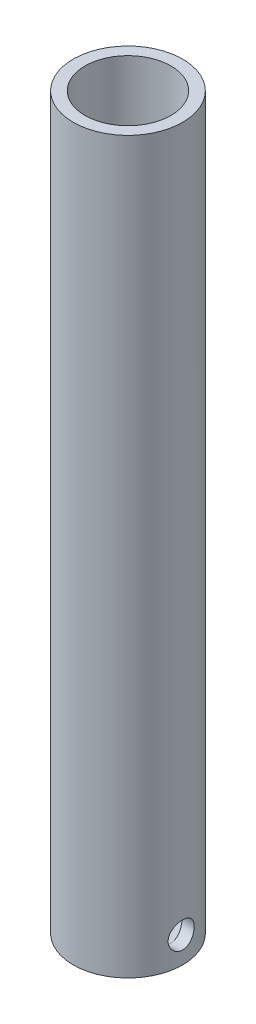
ISO-10303-21;
HEADER;
FILE_DESCRIPTION(('STEP AP214'),'2;1');
FILE_NAME('part.step','',(''),(''),'','','');
FILE_SCHEMA(('AUTOMOTIVE_DESIGN { 1 0 10303 214 1 1 1 1 }'));
ENDSEC;
DATA;
#1=APPLICATION_CONTEXT('core data for automotive mechanical design processes');
#2=APPLICATION_PROTOCOL_DEFINITION('international standard','automotive_design',2000,#1);
#3=PRODUCT_CONTEXT('',#1,'mechanical');
#4=PRODUCT('Part','Part','',(#3));
#5=PRODUCT_RELATED_PRODUCT_CATEGORY('part','',(#4));
#6=PRODUCT_DEFINITION_FORMATION('','',#4);
#7=PRODUCT_DEFINITION_CONTEXT('part definition',#1,'design');
#8=PRODUCT_DEFINITION('design','',#6,#7);
#9=PRODUCT_DEFINITION_SHAPE('','',#8);
#10=(LENGTH_UNIT() NAMED_UNIT(*) SI_UNIT(.MILLI.,.METRE.));
#11=(NAMED_UNIT(*) PLANE_ANGLE_UNIT() SI_UNIT($,.RADIAN.));
#12=(NAMED_UNIT(*) SI_UNIT($,.STERADIAN.) SOLID_ANGLE_UNIT());
#13=UNCERTAINTY_MEASURE_WITH_UNIT(LENGTH_MEASURE(1.E-05),#10,'distance_accuracy_value','');
#14=(GEOMETRIC_REPRESENTATION_CONTEXT(3) GLOBAL_UNCERTAINTY_ASSIGNED_CONTEXT((#13)) GLOBAL_UNIT_ASSIGNED_CONTEXT((#10,
#11,#12)) REPRESENTATION_CONTEXT('',''));
#15=CARTESIAN_POINT('',(0.,0.,0.));
#16=DIRECTION('',(0.,0.,1.));
#17=DIRECTION('',(1.,0.,0.));
#18=AXIS2_PLACEMENT_3D('',#15,#16,#17);
#19=CARTESIAN_POINT('',(0.,177.8,0.));
#20=DIRECTION('',(0.,1.,0.));
#21=DIRECTION('',(0.,0.,1.));
#22=AXIS2_PLACEMENT_3D('',#19,#20,#21);
#23=PLANE('',#22);
#24=CARTESIAN_POINT('',(0.,177.8,0.));
#25=DIRECTION('',(0.,1.,0.));
#26=DIRECTION('',(0.,0.,1.));
#27=AXIS2_PLACEMENT_3D('',#24,#25,#26);
#28=CIRCLE('',#27,13.335);
#29=CARTESIAN_POINT('',(0.,177.8,13.335));
#30=VERTEX_POINT('',#29);
#31=EDGE_CURVE('E51',#30,#30,#28,.T.);
#32=ORIENTED_EDGE('',*,*,#31,.T.);
#33=EDGE_LOOP('',(#32));
#34=FACE_BOUND('',#33,.T.);
#35=CARTESIAN_POINT('',(0.,177.8,0.));
#36=DIRECTION('',(0.,1.,0.));
#37=DIRECTION('',(0.,0.,1.));
#38=AXIS2_PLACEMENT_3D('',#35,#36,#37);
#39=CIRCLE('',#38,10.4648);
#40=CARTESIAN_POINT('',(0.,177.8,10.4648));
#41=VERTEX_POINT('',#40);
#42=EDGE_CURVE('E63',#41,#41,#39,.T.);
#43=ORIENTED_EDGE('',*,*,#42,.F.);
#44=EDGE_LOOP('',(#43));
#45=FACE_BOUND('',#44,.T.);
#46=ADVANCED_FACE('F43',(#34,#45),#23,.T.);
#47=CARTESIAN_POINT('',(0.,0.,0.));
#48=DIRECTION('',(0.,1.,0.));
#49=DIRECTION('',(0.,0.,1.));
#50=AXIS2_PLACEMENT_3D('',#47,#48,#49);
#51=PLANE('',#50);
#52=CARTESIAN_POINT('',(0.,0.,0.));
#53=DIRECTION('',(0.,1.,0.));
#54=DIRECTION('',(0.,0.,1.));
#55=AXIS2_PLACEMENT_3D('',#52,#53,#54);
#56=CIRCLE('',#55,13.335);
#57=CARTESIAN_POINT('',(0.,0.,13.335));
#58=VERTEX_POINT('',#57);
#59=EDGE_CURVE('E101',#58,#58,#56,.T.);
#60=ORIENTED_EDGE('',*,*,#59,.F.);
#61=EDGE_LOOP('',(#60));
#62=FACE_BOUND('',#61,.T.);
#63=ADVANCED_FACE('F89',(#62),#51,.F.);
#64=CARTESIAN_POINT('',(0.,177.8,0.));
#65=DIRECTION('',(0.,-1.,0.));
#66=DIRECTION('',(0.,0.,-1.));
#67=AXIS2_PLACEMENT_3D('',#64,#65,#66);
#68=CYLINDRICAL_SURFACE('',#67,13.335);
#69=CARTESIAN_POINT('',(12.9515095645257,6.35,-3.175));
#70=CARTESIAN_POINT('',(12.9515130431755,6.17439268882723,-3.17499456149958));
#71=CARTESIAN_POINT('',(12.9551200740808,5.99872324079252,-3.16038129676346));
#72=CARTESIAN_POINT('',(12.9691257629382,5.65240960761978,-3.10239586208023));
#73=CARTESIAN_POINT('',(12.9795287491152,5.48176869750205,-3.05900536414934));
#74=CARTESIAN_POINT('',(13.0058828751809,5.15057144948299,-2.9449335746023));
#75=CARTESIAN_POINT('',(13.0218272781896,4.99000314453766,-2.87428540958144));
#76=CARTESIAN_POINT('',(13.0574594405973,4.68298582845107,-2.70780239363046));
#77=CARTESIAN_POINT('',(13.0771472670241,4.5365370701979,-2.6119670917007));
#78=CARTESIAN_POINT('',(13.118487955002,4.25898963213897,-2.39578669769674));
#79=CARTESIAN_POINT('',(13.1401697933428,4.12821445719424,-2.275031731239));
#80=CARTESIAN_POINT('',(13.1828032471772,3.88856980049286,-2.01332346761705));
#81=CARTESIAN_POINT('',(13.2037547990052,3.77970222469191,-1.87236841487529));
#82=CARTESIAN_POINT('',(13.2428856684522,3.58565681873217,-1.57206341806932));
#83=CARTESIAN_POINT('',(13.2610268017373,3.50079418578502,-1.41250440071767));
#84=CARTESIAN_POINT('',(13.2921635256137,3.35921295929078,-1.08088354694045));
#85=CARTESIAN_POINT('',(13.3051598028521,3.30249060980533,-0.908823382583764));
#86=CARTESIAN_POINT('',(13.3243376708765,3.21982892912495,-0.560453733464584));
#87=CARTESIAN_POINT('',(13.3306405767352,3.19334092311204,-0.38428123187962));
#88=CARTESIAN_POINT('',(13.3361433296159,3.17018025143552,-0.0298879327775142));
#89=CARTESIAN_POINT('',(13.3353441328959,3.1735035718454,0.148332585758552));
#90=CARTESIAN_POINT('',(13.3268239897638,3.20947104212122,0.497966648337663));
#91=CARTESIAN_POINT('',(13.3192427776362,3.24152329674306,0.66944499478662));
#92=CARTESIAN_POINT('',(13.2981717176837,3.33309064106691,1.00451605305304));
#93=CARTESIAN_POINT('',(13.2846815726295,3.39260711227353,1.1681083677302));
#94=CARTESIAN_POINT('',(13.2530902860291,3.53790979006892,1.48435595195096));
#95=CARTESIAN_POINT('',(13.2349514401953,3.62391202366408,1.63690804508806));
#96=CARTESIAN_POINT('',(13.1960389427811,3.81958223465688,1.92562579910209));
#97=CARTESIAN_POINT('',(13.1752648716533,3.92925398237128,2.06178884397884));
#98=CARTESIAN_POINT('',(13.1327510700209,4.17234306728273,2.31739012492049));
#99=CARTESIAN_POINT('',(13.1110001555929,4.30627806633791,2.4363346715475));
#100=CARTESIAN_POINT('',(13.0694560402835,4.59242128646861,2.65017821938942));
#101=CARTESIAN_POINT('',(13.0496629143456,4.74463020657089,2.74507630032997));
#102=CARTESIAN_POINT('',(13.0142391582439,5.06390107980447,2.9084101584116));
#103=CARTESIAN_POINT('',(12.9986256984092,5.23102065192913,2.97673728499364));
#104=CARTESIAN_POINT('',(12.9735553540214,5.5748334858167,3.08417943263225));
#105=CARTESIAN_POINT('',(12.9640972895066,5.7515249056602,3.12330005265765));
#106=CARTESIAN_POINT('',(12.9526536037414,6.10491393255616,3.17042088350117));
#107=CARTESIAN_POINT('',(12.9504938045518,6.28150926929882,3.17914664706702));
#108=CARTESIAN_POINT('',(12.9534187520608,6.63363194331723,3.16720775994804));
#109=CARTESIAN_POINT('',(12.9585029000799,6.80915936764714,3.14654553804755));
#110=CARTESIAN_POINT('',(12.9751769200354,7.15153656787627,3.07705085024721));
#111=CARTESIAN_POINT('',(12.9866712723459,7.31847532843714,3.02863170601553));
#112=CARTESIAN_POINT('',(13.0147816768645,7.64186876910355,2.90545158987758));
#113=CARTESIAN_POINT('',(13.0313982912689,7.79832229610153,2.83068772636532));
#114=CARTESIAN_POINT('',(13.0682539584389,8.09940435837598,2.65539046463786));
#115=CARTESIAN_POINT('',(13.0885527493023,8.24376982607036,2.55441806406798));
#116=CARTESIAN_POINT('',(13.130334807601,8.51377434800442,2.33013260902021));
#117=CARTESIAN_POINT('',(13.1518182504637,8.63941061850323,2.20681623955644));
#118=CARTESIAN_POINT('',(13.1941329207867,8.8712806845595,1.93803169385745));
#119=CARTESIAN_POINT('',(13.2149386661668,8.97701538559903,1.79212823662935));
#120=CARTESIAN_POINT('',(13.2530512846874,9.16247834341892,1.48421240082465));
#121=CARTESIAN_POINT('',(13.2703583346173,9.24220791436577,1.32220083680958));
#122=CARTESIAN_POINT('',(13.29941785029,9.37273979661517,0.987754847062244));
#123=CARTESIAN_POINT('',(13.3112086066186,9.42374203506786,0.815401933280338));
#124=CARTESIAN_POINT('',(13.3280739114212,9.49598248181445,0.464256981614203));
#125=CARTESIAN_POINT('',(13.3331496281747,9.51722586757761,0.285466069371487));
#126=CARTESIAN_POINT('',(13.3359703889066,9.52907721665376,-0.0687721336588608));
#127=CARTESIAN_POINT('',(13.3338924643413,9.52042498841826,-0.244193658483457));
#128=CARTESIAN_POINT('',(13.3230267372412,9.47440950653612,-0.591006126722574));
#129=CARTESIAN_POINT('',(13.3142391013424,9.43704696591102,-0.762397170125291));
#130=CARTESIAN_POINT('',(13.2909632038767,9.33505233562849,-1.09558846328029));
#131=CARTESIAN_POINT('',(13.27650057029,9.27054274695929,-1.25742811833028));
#132=CARTESIAN_POINT('',(13.2434056848544,9.11619865473318,-1.56807577167177));
#133=CARTESIAN_POINT('',(13.2247729522858,9.0263612311296,-1.71688226477556));
#134=CARTESIAN_POINT('',(13.1848433880495,8.82159360090471,-2.00078845722473));
#135=CARTESIAN_POINT('',(13.1634968926615,8.70615401136944,-2.13551379588763));
#136=CARTESIAN_POINT('',(13.1207856218596,8.45446335477035,-2.38393226701744));
#137=CARTESIAN_POINT('',(13.0994208432258,8.31820713533026,-2.49762017701065));
#138=CARTESIAN_POINT('',(13.0586939534724,8.0260451015803,-2.70256579836446));
#139=CARTESIAN_POINT('',(13.0393706982401,7.86985219094552,-2.79342250524195));
#140=CARTESIAN_POINT('',(13.0054227494587,7.5439764469342,-2.94745148659029));
#141=CARTESIAN_POINT('',(12.9907944145069,7.37430419625136,-3.01064523050147));
#142=CARTESIAN_POINT('',(12.9703469124297,7.06227629273009,-3.09739525243156));
#143=CARTESIAN_POINT('',(12.9633335061891,6.92149851378257,-3.12643671616753));
#144=CARTESIAN_POINT('',(12.9539135690808,6.63716087823738,-3.16524064753339));
#145=CARTESIAN_POINT('',(12.9515067198927,6.49360121456493,-3.17500444728218));
#146=CARTESIAN_POINT('',(12.9515095645257,6.35,-3.175));
#147=B_SPLINE_CURVE_WITH_KNOTS('',3,(#69,#70,#71,#72,#73,#74,#75,#76,#77,#78,#79,#80,#81,#82,
#83,#84,#85,#86,#87,#88,#89,#90,#91,#92,#93,#94,#95,#96,#97,#98,#99,#100,#101,#102,#103,#104,
#105,#106,#107,#108,#109,#110,#111,#112,#113,#114,#115,#116,#117,#118,#119,#120,#121,#122,#123,
#124,#125,#126,#127,#128,#129,#130,#131,#132,#133,#134,#135,#136,#137,#138,#139,#140,#141,#142,
#143,#144,#145,#146),.UNSPECIFIED.,.T.,.F.,(4,2,2,2,2,2,2,2,2,2,2,2,2,2,2,2,2,2,2,2,2,2,2,2,2,2,
2,2,2,2,2,2,2,2,2,2,2,2,4),(0.,0.526295023569184,1.05292556242485,1.57891808620836,
2.10492002902979,2.6403837329889,3.17589400203579,3.71814000187963,4.26031360761066,
4.79248341941362,5.3245815786366,5.84596281603142,6.36737028279646,6.89314850855961,
7.41901054742838,7.95780562049122,8.49662131048932,9.03761765397032,9.57851026029277,
10.1063993133018,10.6342447411986,11.1544270735389,11.6746665190755,12.2042561691891,
12.7339244544748,13.2754877679726,13.8170237093841,14.3547427431345,14.8923682124687,
15.4167856696078,15.9411901032431,16.4632531169852,16.9853763440143,17.5190066122244,
18.0527691752265,18.5953378964269,19.13748477601,19.567887286663,19.9982600547402),.UNSPECIFIED.);
#148=CARTESIAN_POINT('',(12.9515095645257,6.35,-3.175));
#149=VERTEX_POINT('',#148);
#150=EDGE_CURVE('E60',#149,#149,#147,.T.);
#151=ORIENTED_EDGE('',*,*,#150,.T.);
#152=EDGE_LOOP('',(#151));
#153=FACE_BOUND('',#152,.T.);
#154=ORIENTED_EDGE('',*,*,#31,.F.);
#155=EDGE_LOOP('',(#154));
#156=FACE_BOUND('',#155,.T.);
#157=ORIENTED_EDGE('',*,*,#59,.T.);
#158=EDGE_LOOP('',(#157));
#159=FACE_BOUND('',#158,.T.);
#160=ADVANCED_FACE('F45',(#153,#156,#159),#68,.T.);
#161=CARTESIAN_POINT('',(0.,177.8,0.));
#162=DIRECTION('',(0.,-1.,0.));
#163=DIRECTION('',(0.,0.,-1.));
#164=AXIS2_PLACEMENT_3D('',#161,#162,#163);
#165=CYLINDRICAL_SURFACE('',#164,10.4648);
#166=CARTESIAN_POINT('',(0.,3.17500000000001,0.));
#167=DIRECTION('',(0.,1.,0.));
#168=DIRECTION('',(0.,0.,1.));
#169=AXIS2_PLACEMENT_3D('',#166,#167,#168);
#170=CIRCLE('',#169,10.4648);
#171=CARTESIAN_POINT('',(10.4648,3.17500000000001,0.));
#172=VERTEX_POINT('',#171);
#173=EDGE_CURVE('E11',#172,#172,#170,.T.);
#174=ORIENTED_EDGE('',*,*,#173,.F.);
#175=CARTESIAN_POINT('',(10.4648,3.17500000000001,0.));
#176=CARTESIAN_POINT('',(10.4647986617218,3.17500185842707,0.174085791757476));
#177=CARTESIAN_POINT('',(10.4604146425794,3.18936512225565,0.348190415023919));
#178=CARTESIAN_POINT('',(10.4433545477958,3.24629850489731,0.691323806841764));
#179=CARTESIAN_POINT('',(10.4306761598271,3.28887648953241,0.860351146185825));
#180=CARTESIAN_POINT('',(10.3984154074654,3.4006826435155,1.18833151160114));
#181=CARTESIAN_POINT('',(10.378843367622,3.4698709730026,1.34729918620782));
#182=CARTESIAN_POINT('',(10.3348259777607,3.63276879356977,1.65137692524628));
#183=CARTESIAN_POINT('',(10.3103799468613,3.72648171123176,1.79648504934778));
#184=CARTESIAN_POINT('',(10.2584178418927,3.93866055876814,2.07297592075698));
#185=CARTESIAN_POINT('',(10.2308377755757,4.05771444269745,2.20389541172417));
#186=CARTESIAN_POINT('',(10.1760947883233,4.31594293361307,2.44425040193427));
#187=CARTESIAN_POINT('',(10.1489319402852,4.45512101348485,2.5536821852851));
#188=CARTESIAN_POINT('',(10.0974192654073,4.75359122523631,2.75041301060926));
#189=CARTESIAN_POINT('',(10.0731488148408,4.91327339213416,2.83714305330425));
#190=CARTESIAN_POINT('',(10.0311269646774,5.24581172595714,2.98232870735195));
#191=CARTESIAN_POINT('',(10.0133739594642,5.41866463549338,3.04079128371099));
#192=CARTESIAN_POINT('',(9.98706459368089,5.76742887493692,3.12610537194363));
#193=CARTESIAN_POINT('',(9.97825995433705,5.94311170157846,3.15381236621464));
#194=CARTESIAN_POINT('',(9.97010600364055,6.29683585599485,3.17950049187145));
#195=CARTESIAN_POINT('',(9.97075434232142,6.4748765866105,3.17748901113061));
#196=CARTESIAN_POINT('',(9.98121328790726,6.82127392246991,3.14446846693764));
#197=CARTESIAN_POINT('',(9.99068391016447,6.98974506726894,3.11453536253537));
#198=CARTESIAN_POINT('',(10.0171696823831,7.31915180894168,3.02826130050455));
#199=CARTESIAN_POINT('',(10.0341855922242,7.48008664503467,2.97191768306232));
#200=CARTESIAN_POINT('',(10.0741131026089,7.79246575471935,2.83363827217465));
#201=CARTESIAN_POINT('',(10.097103619497,7.94374636100498,2.75135650870513));
#202=CARTESIAN_POINT('',(10.1463524361709,8.23071142857712,2.5637768928088));
#203=CARTESIAN_POINT('',(10.1726115426453,8.36639202381987,2.45847335373298));
#204=CARTESIAN_POINT('',(10.2268136386414,8.62440294619032,2.22251280965219));
#205=CARTESIAN_POINT('',(10.2547806155465,8.745914208801,2.09096414657382));
#206=CARTESIAN_POINT('',(10.3082534288056,8.96534441064496,1.80900855193586));
#207=CARTESIAN_POINT('',(10.333759103062,9.06326179665658,1.65860037981585));
#208=CARTESIAN_POINT('',(10.3796775718903,9.23323741007334,1.34168261077194));
#209=CARTESIAN_POINT('',(10.400053556332,9.3051102741263,1.17506790455787));
#210=CARTESIAN_POINT('',(10.4331514492843,9.41957018405692,0.831353135387342));
#211=CARTESIAN_POINT('',(10.4458755431414,9.46216559194565,0.654256082029787));
#212=CARTESIAN_POINT('',(10.4618887330504,9.5154893760117,0.301563956616359));
#213=CARTESIAN_POINT('',(10.4655062406643,9.52732748396872,0.126151326625978));
#214=CARTESIAN_POINT('',(10.4638642470164,9.52191600243229,-0.224167411145475));
#215=CARTESIAN_POINT('',(10.4586059605044,9.50467039336507,-0.399073584958942));
#216=CARTESIAN_POINT('',(10.4400184163769,9.44247664063109,-0.739201309539023));
#217=CARTESIAN_POINT('',(10.426879133646,9.3981801288615,-0.904553382813669));
#218=CARTESIAN_POINT('',(10.3940546944459,9.28392897302279,-1.22543973823902));
#219=CARTESIAN_POINT('',(10.374368744878,9.21397122010615,-1.38097282814729));
#220=CARTESIAN_POINT('',(10.3299109622227,9.04854121974589,-1.68186432003312));
#221=CARTESIAN_POINT('',(10.3050305702973,8.95250848518414,-1.82689809280926));
#222=CARTESIAN_POINT('',(10.2530373765631,8.73833328112267,-2.09916844652685));
#223=CARTESIAN_POINT('',(10.2259240037326,8.62018514634181,-2.22640045258005));
#224=CARTESIAN_POINT('',(10.1712550560922,8.35991727304897,-2.464363252041));
#225=CARTESIAN_POINT('',(10.1437205543807,8.21706926545413,-2.57430409133572));
#226=CARTESIAN_POINT('',(10.0923936224058,7.91435329836792,-2.76871370657528));
#227=CARTESIAN_POINT('',(10.0686011034926,7.75448574223077,-2.85318308599833));
#228=CARTESIAN_POINT('',(10.0277236290392,7.4227329738587,-2.99368686315083));
#229=CARTESIAN_POINT('',(10.0106087955503,7.25090544267916,-3.04984825668389));
#230=CARTESIAN_POINT('',(9.98513227972216,6.89961344129597,-3.13226262752658));
#231=CARTESIAN_POINT('',(9.97676751037823,6.72015168769957,-3.15852615303149));
#232=CARTESIAN_POINT('',(9.97004707736549,6.36690567240054,-3.17967114892858));
#233=CARTESIAN_POINT('',(9.97127998720401,6.19320545573612,-3.17584251831101));
#234=CARTESIAN_POINT('',(9.98262405408681,5.84904814284412,-3.1400002339761));
#235=CARTESIAN_POINT('',(9.99273484032714,5.67859091146995,-3.10798775741866));
#236=CARTESIAN_POINT('',(10.0204163124529,5.34791981283285,-3.01752759267743));
#237=CARTESIAN_POINT('',(10.0378883515011,5.18760161965119,-2.95942882906993));
#238=CARTESIAN_POINT('',(10.0783036079247,4.87886030738402,-2.81871769240387));
#239=CARTESIAN_POINT('',(10.1012478905067,4.7304395117263,-2.73610054592254));
#240=CARTESIAN_POINT('',(10.1510863731292,4.44373924091537,-2.54510423755544));
#241=CARTESIAN_POINT('',(10.1780956633422,4.30604151179636,-2.43588189296318));
#242=CARTESIAN_POINT('',(10.2324700801367,4.05051079926891,-2.19628414234308));
#243=CARTESIAN_POINT('',(10.2598352980599,3.93268302792567,-2.06590320377428));
#244=CARTESIAN_POINT('',(10.312827143881,3.71669376067237,-1.78295800224454));
#245=CARTESIAN_POINT('',(10.3383765210939,3.61923196815438,-1.6298436147307));
#246=CARTESIAN_POINT('',(10.3839193332026,3.45156833153372,-1.30862720541263));
#247=CARTESIAN_POINT('',(10.4039152558968,3.38135427555857,-1.14053193936208));
#248=CARTESIAN_POINT('',(10.4344464505852,3.27615510958335,-0.811682738488879));
#249=CARTESIAN_POINT('',(10.4457337009742,3.23832645615598,-0.651904186876146));
#250=CARTESIAN_POINT('',(10.4609104548398,3.18775023425305,-0.328088827928714));
#251=CARTESIAN_POINT('',(10.4648012611497,3.17499824867893,-0.164052775684675));
#252=CARTESIAN_POINT('',(10.4648,3.17500000000001,0.));
#253=B_SPLINE_CURVE_WITH_KNOTS('',3,(#175,#176,#177,#178,#179,#180,#181,#182,#183,#184,#185,
#186,#187,#188,#189,#190,#191,#192,#193,#194,#195,#196,#197,#198,#199,#200,#201,#202,#203,#204,
#205,#206,#207,#208,#209,#210,#211,#212,#213,#214,#215,#216,#217,#218,#219,#220,#221,#222,#223,
#224,#225,#226,#227,#228,#229,#230,#231,#232,#233,#234,#235,#236,#237,#238,#239,#240,#241,#242,
#243,#244,#245,#246,#247,#248,#249,#250,#251,#252),.UNSPECIFIED.,.T.,.F.,(4,2,2,2,2,2,2,2,2,2,2,
2,2,2,2,2,2,2,2,2,2,2,2,2,2,2,2,2,2,2,2,2,2,2,2,2,2,2,4),(0.,0.52165466462189,1.04345481960682,
1.56447677995741,2.08557157653573,2.62041771611716,3.15535626590974,3.70263889078639,
4.24978659830422,4.78130086235867,5.31268299668646,5.8243986179154,6.33616578531226,
6.85507048073546,7.37410349682591,7.91533299088818,8.45659810520282,9.00164315554423,
9.54653246937937,10.071470162541,10.5963360180418,11.1090314157861,11.6217889468671,
12.1465854532631,12.6715165807236,13.2159759600474,13.7604224388462,14.3024041743159,
14.8441946351869,15.3628920799563,15.8815678612216,16.3935035828454,16.9055390374144,
17.4366004088074,17.9678008663295,18.5150102132336,19.0619740281945,19.5536509939672,
20.04524134615),.UNSPECIFIED.);
#254=EDGE_CURVE('E55',#172,#172,#253,.T.);
#255=ORIENTED_EDGE('',*,*,#254,.F.);
#256=EDGE_LOOP('',(#174,#255));
#257=FACE_BOUND('',#256,.T.);
#258=ORIENTED_EDGE('',*,*,#42,.T.);
#259=EDGE_LOOP('',(#258));
#260=FACE_BOUND('',#259,.T.);
#261=ADVANCED_FACE('F74',(#257,#260),#165,.F.);
#262=CARTESIAN_POINT('',(0.,3.175,0.));
#263=DIRECTION('',(0.,1.,0.));
#264=DIRECTION('',(0.,0.,1.));
#265=AXIS2_PLACEMENT_3D('',#262,#263,#264);
#266=PLANE('',#265);
#267=ORIENTED_EDGE('',*,*,#173,.T.);
#268=EDGE_LOOP('',(#267));
#269=FACE_BOUND('',#268,.T.);
#270=ADVANCED_FACE('F80',(#269),#266,.T.);
#271=CARTESIAN_POINT('',(-1.016,6.35,0.));
#272=DIRECTION('',(1.,0.,0.));
#273=DIRECTION('',(0.,0.,-1.));
#274=AXIS2_PLACEMENT_3D('',#271,#272,#273);
#275=CYLINDRICAL_SURFACE('',#274,3.175);
#276=ORIENTED_EDGE('',*,*,#254,.T.);
#277=EDGE_LOOP('',(#276));
#278=FACE_BOUND('',#277,.T.);
#279=ORIENTED_EDGE('',*,*,#150,.F.);
#280=EDGE_LOOP('',(#279));
#281=FACE_BOUND('',#280,.T.);
#282=ADVANCED_FACE('F56',(#278,#281),#275,.F.);
#283=CLOSED_SHELL('',(#46,#63,#160,#261,#270,#282));
#284=MANIFOLD_SOLID_BREP('B2',#283);
#285=ADVANCED_BREP_SHAPE_REPRESENTATION('',(#18,#284),#14);
#286=SHAPE_DEFINITION_REPRESENTATION(#9,#285);
ENDSEC;
END-ISO-10303-21;
